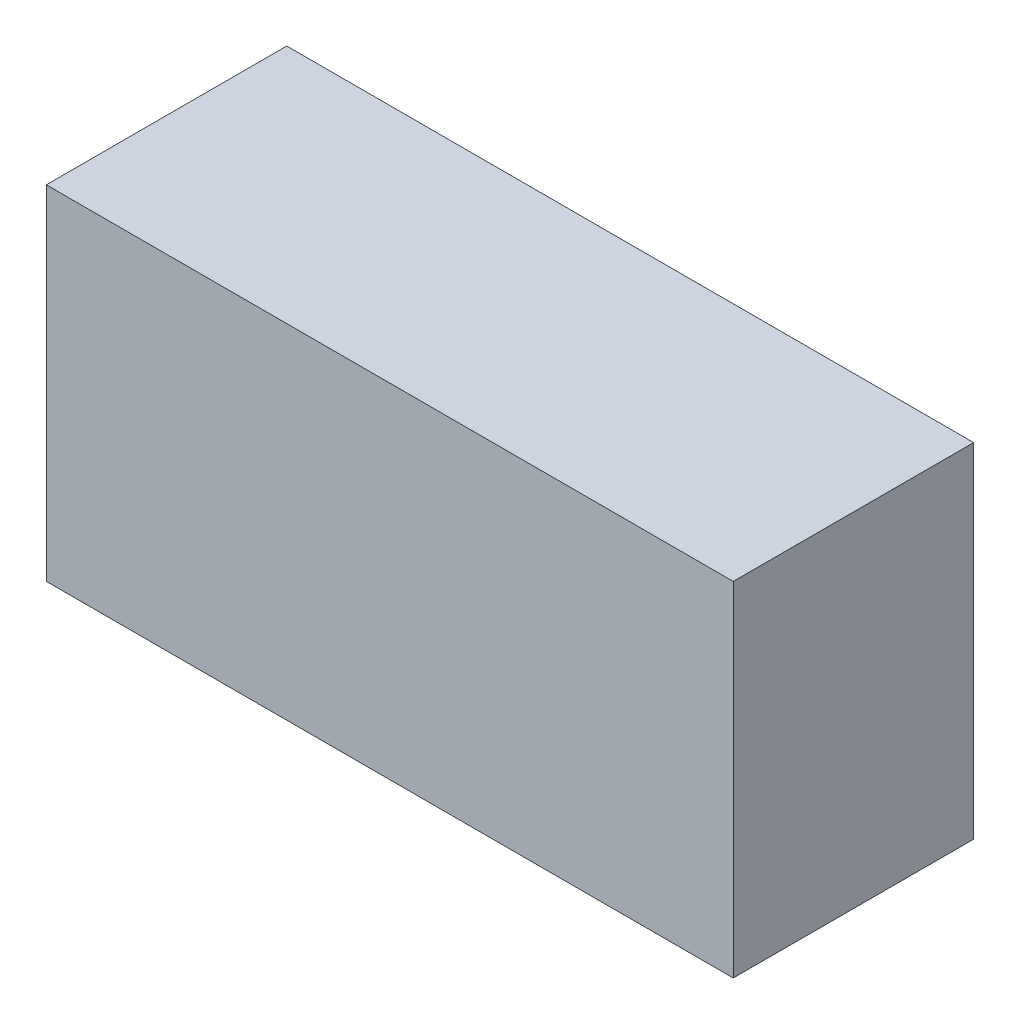
ISO-10303-21;
HEADER;
FILE_DESCRIPTION(('STEP AP214'),'2;1');
FILE_NAME('part.step','',(''),(''),'','','');
FILE_SCHEMA(('AUTOMOTIVE_DESIGN { 1 0 10303 214 1 1 1 1 }'));
ENDSEC;
DATA;
#1=APPLICATION_CONTEXT('core data for automotive mechanical design processes');
#2=APPLICATION_PROTOCOL_DEFINITION('international standard','automotive_design',2000,#1);
#3=PRODUCT_CONTEXT('',#1,'mechanical');
#4=PRODUCT('Part','Part','',(#3));
#5=PRODUCT_RELATED_PRODUCT_CATEGORY('part','',(#4));
#6=PRODUCT_DEFINITION_FORMATION('','',#4);
#7=PRODUCT_DEFINITION_CONTEXT('part definition',#1,'design');
#8=PRODUCT_DEFINITION('design','',#6,#7);
#9=PRODUCT_DEFINITION_SHAPE('','',#8);
#10=(LENGTH_UNIT() NAMED_UNIT(*) SI_UNIT(.MILLI.,.METRE.));
#11=(NAMED_UNIT(*) PLANE_ANGLE_UNIT() SI_UNIT($,.RADIAN.));
#12=(NAMED_UNIT(*) SI_UNIT($,.STERADIAN.) SOLID_ANGLE_UNIT());
#13=UNCERTAINTY_MEASURE_WITH_UNIT(LENGTH_MEASURE(1.E-05),#10,'distance_accuracy_value','');
#14=(GEOMETRIC_REPRESENTATION_CONTEXT(3) GLOBAL_UNCERTAINTY_ASSIGNED_CONTEXT((#13)) GLOBAL_UNIT_ASSIGNED_CONTEXT((#10,
#11,#12)) REPRESENTATION_CONTEXT('',''));
#15=CARTESIAN_POINT('',(0.,0.,0.));
#16=DIRECTION('',(0.,0.,1.));
#17=DIRECTION('',(1.,0.,0.));
#18=AXIS2_PLACEMENT_3D('',#15,#16,#17);
#19=CARTESIAN_POINT('',(-0.499999,0.2499995,0.3499993));
#20=DIRECTION('',(0.,0.,1.));
#21=DIRECTION('',(1.,0.,0.));
#22=AXIS2_PLACEMENT_3D('',#19,#20,#21);
#23=PLANE('',#22);
#24=DIRECTION('',(0.,1.,0.));
#25=VECTOR('',#24,1.);
#26=CARTESIAN_POINT('',(0.50000154,-0.2499995,0.3499993));
#27=LINE('',#26,#25);
#28=CARTESIAN_POINT('',(0.50000154,-0.2499995,0.3499993));
#29=VERTEX_POINT('',#28);
#30=CARTESIAN_POINT('',(0.50000154,0.2499995,0.3499993));
#31=VERTEX_POINT('',#30);
#32=EDGE_CURVE('E75',#29,#31,#27,.T.);
#33=ORIENTED_EDGE('',*,*,#32,.T.);
#34=DIRECTION('',(1.,0.,0.));
#35=VECTOR('',#34,1.);
#36=CARTESIAN_POINT('',(0.50000154,0.2499995,0.3499993));
#37=LINE('',#36,#35);
#38=CARTESIAN_POINT('',(-0.499997095,0.249998865,0.3499993));
#39=VERTEX_POINT('',#38);
#40=EDGE_CURVE('E57',#31,#39,#37,.F.);
#41=ORIENTED_EDGE('',*,*,#40,.T.);
#42=DIRECTION('',(0.,1.,0.));
#43=VECTOR('',#42,1.);
#44=CARTESIAN_POINT('',(-0.49999646,0.24999696,0.3499993));
#45=LINE('',#44,#43);
#46=CARTESIAN_POINT('',(-0.49999646,-0.2499995,0.3499993));
#47=VERTEX_POINT('',#46);
#48=EDGE_CURVE('E19',#39,#47,#45,.F.);
#49=ORIENTED_EDGE('',*,*,#48,.T.);
#50=DIRECTION('',(1.,0.,0.));
#51=VECTOR('',#50,1.);
#52=CARTESIAN_POINT('',(-0.49999646,-0.2499995,0.3499993));
#53=LINE('',#52,#51);
#54=EDGE_CURVE('E54',#47,#29,#53,.T.);
#55=ORIENTED_EDGE('',*,*,#54,.T.);
#56=EDGE_LOOP('',(#33,#41,#49,#55));
#57=FACE_BOUND('',#56,.T.);
#58=ADVANCED_FACE('F16',(#57),#23,.T.);
#59=CARTESIAN_POINT('',(-0.49999646,0.24999696,0.));
#60=DIRECTION('',(1.,0.,0.));
#61=DIRECTION('',(0.,0.,-1.));
#62=AXIS2_PLACEMENT_3D('',#59,#60,#61);
#63=PLANE('',#62);
#64=DIRECTION('',(0.,0.,1.));
#65=VECTOR('',#64,1.);
#66=CARTESIAN_POINT('',(-0.49999646,-0.2499995,0.));
#67=LINE('',#66,#65);
#68=CARTESIAN_POINT('',(-0.49999646,-0.2499995,0.));
#69=VERTEX_POINT('',#68);
#70=EDGE_CURVE('E62',#69,#47,#67,.T.);
#71=ORIENTED_EDGE('',*,*,#70,.T.);
#72=ORIENTED_EDGE('',*,*,#48,.F.);
#73=DIRECTION('',(0.,0.,-1.));
#74=VECTOR('',#73,1.);
#75=CARTESIAN_POINT('',(-0.499999,0.2499995,0.));
#76=LINE('',#75,#74);
#77=CARTESIAN_POINT('',(-0.499997095,0.24999823,0.));
#78=VERTEX_POINT('',#77);
#79=EDGE_CURVE('E79',#39,#78,#76,.T.);
#80=ORIENTED_EDGE('',*,*,#79,.T.);
#81=DIRECTION('',(0.,1.,0.));
#82=VECTOR('',#81,1.);
#83=CARTESIAN_POINT('',(-0.49999646,0.2499995,0.));
#84=LINE('',#83,#82);
#85=EDGE_CURVE('E72',#78,#69,#84,.F.);
#86=ORIENTED_EDGE('',*,*,#85,.T.);
#87=EDGE_LOOP('',(#71,#72,#80,#86));
#88=FACE_BOUND('',#87,.T.);
#89=ADVANCED_FACE('F71',(#88),#63,.F.);
#90=CARTESIAN_POINT('',(-0.49999646,-0.2499995,0.));
#91=DIRECTION('',(0.,1.,0.));
#92=DIRECTION('',(0.,0.,1.));
#93=AXIS2_PLACEMENT_3D('',#90,#91,#92);
#94=PLANE('',#93);
#95=DIRECTION('',(0.,0.,1.));
#96=VECTOR('',#95,1.);
#97=CARTESIAN_POINT('',(0.50000154,-0.2499995,0.));
#98=LINE('',#97,#96);
#99=CARTESIAN_POINT('',(0.50000154,-0.2499995,0.));
#100=VERTEX_POINT('',#99);
#101=EDGE_CURVE('E68',#100,#29,#98,.T.);
#102=ORIENTED_EDGE('',*,*,#101,.T.);
#103=ORIENTED_EDGE('',*,*,#54,.F.);
#104=ORIENTED_EDGE('',*,*,#70,.F.);
#105=DIRECTION('',(1.,0.,0.));
#106=VECTOR('',#105,1.);
#107=CARTESIAN_POINT('',(-0.499999,-0.2499995,0.));
#108=LINE('',#107,#106);
#109=EDGE_CURVE('E82',#69,#100,#108,.T.);
#110=ORIENTED_EDGE('',*,*,#109,.T.);
#111=EDGE_LOOP('',(#102,#103,#104,#110));
#112=FACE_BOUND('',#111,.T.);
#113=ADVANCED_FACE('F65',(#112),#94,.F.);
#114=CARTESIAN_POINT('',(0.50000154,-0.2499995,0.));
#115=DIRECTION('',(-1.,0.,0.));
#116=DIRECTION('',(0.,0.,1.));
#117=AXIS2_PLACEMENT_3D('',#114,#115,#116);
#118=PLANE('',#117);
#119=DIRECTION('',(0.,0.,-1.));
#120=VECTOR('',#119,1.);
#121=CARTESIAN_POINT('',(0.50000154,0.2499995,0.));
#122=LINE('',#121,#120);
#123=CARTESIAN_POINT('',(0.50000154,0.2499995,0.));
#124=VERTEX_POINT('',#123);
#125=EDGE_CURVE('E33',#124,#31,#122,.F.);
#126=ORIENTED_EDGE('',*,*,#125,.T.);
#127=ORIENTED_EDGE('',*,*,#32,.F.);
#128=ORIENTED_EDGE('',*,*,#101,.F.);
#129=DIRECTION('',(0.,1.,0.));
#130=VECTOR('',#129,1.);
#131=CARTESIAN_POINT('',(0.50000154,0.2499995,0.));
#132=LINE('',#131,#130);
#133=EDGE_CURVE('E25',#100,#124,#132,.T.);
#134=ORIENTED_EDGE('',*,*,#133,.T.);
#135=EDGE_LOOP('',(#126,#127,#128,#134));
#136=FACE_BOUND('',#135,.T.);
#137=ADVANCED_FACE('F87',(#136),#118,.F.);
#138=CARTESIAN_POINT('',(0.50000154,0.2499995,0.));
#139=DIRECTION('',(0.,-1.,0.));
#140=DIRECTION('',(0.,0.,-1.));
#141=AXIS2_PLACEMENT_3D('',#138,#139,#140);
#142=PLANE('',#141);
#143=ORIENTED_EDGE('',*,*,#79,.F.);
#144=ORIENTED_EDGE('',*,*,#40,.F.);
#145=ORIENTED_EDGE('',*,*,#125,.F.);
#146=DIRECTION('',(1.,0.,0.));
#147=VECTOR('',#146,1.);
#148=CARTESIAN_POINT('',(-0.499999,0.2499995,0.));
#149=LINE('',#148,#147);
#150=EDGE_CURVE('E11',#124,#78,#149,.F.);
#151=ORIENTED_EDGE('',*,*,#150,.T.);
#152=EDGE_LOOP('',(#143,#144,#145,#151));
#153=FACE_BOUND('',#152,.T.);
#154=ADVANCED_FACE('F90',(#153),#142,.F.);
#155=CARTESIAN_POINT('',(-0.499999,0.2499995,0.));
#156=DIRECTION('',(0.,0.,1.));
#157=DIRECTION('',(1.,0.,0.));
#158=AXIS2_PLACEMENT_3D('',#155,#156,#157);
#159=PLANE('',#158);
#160=ORIENTED_EDGE('',*,*,#133,.F.);
#161=ORIENTED_EDGE('',*,*,#109,.F.);
#162=ORIENTED_EDGE('',*,*,#85,.F.);
#163=ORIENTED_EDGE('',*,*,#150,.F.);
#164=EDGE_LOOP('',(#160,#161,#162,#163));
#165=FACE_BOUND('',#164,.T.);
#166=ADVANCED_FACE('F89',(#165),#159,.F.);
#167=CLOSED_SHELL('',(#58,#89,#113,#137,#154,#166));
#168=MANIFOLD_SOLID_BREP('B1',#167);
#169=ADVANCED_BREP_SHAPE_REPRESENTATION('',(#18,#168),#14);
#170=SHAPE_DEFINITION_REPRESENTATION(#9,#169);
ENDSEC;
END-ISO-10303-21;
